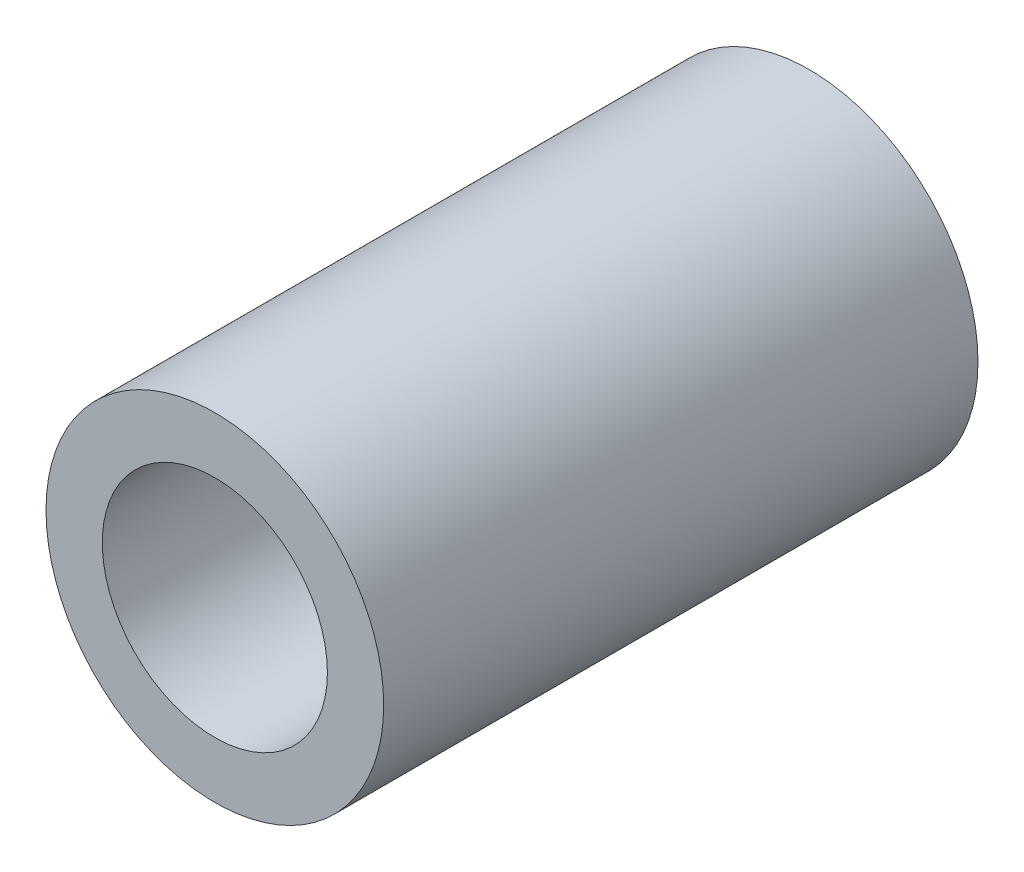
ISO-10303-21;
HEADER;
FILE_DESCRIPTION(('STEP AP214'),'2;1');
FILE_NAME('part.step','',(''),(''),'','','');
FILE_SCHEMA(('AUTOMOTIVE_DESIGN { 1 0 10303 214 1 1 1 1 }'));
ENDSEC;
DATA;
#1=APPLICATION_CONTEXT('core data for automotive mechanical design processes');
#2=APPLICATION_PROTOCOL_DEFINITION('international standard','automotive_design',2000,#1);
#3=PRODUCT_CONTEXT('',#1,'mechanical');
#4=PRODUCT('Part','Part','',(#3));
#5=PRODUCT_RELATED_PRODUCT_CATEGORY('part','',(#4));
#6=PRODUCT_DEFINITION_FORMATION('','',#4);
#7=PRODUCT_DEFINITION_CONTEXT('part definition',#1,'design');
#8=PRODUCT_DEFINITION('design','',#6,#7);
#9=PRODUCT_DEFINITION_SHAPE('','',#8);
#10=(LENGTH_UNIT() NAMED_UNIT(*) SI_UNIT(.MILLI.,.METRE.));
#11=(NAMED_UNIT(*) PLANE_ANGLE_UNIT() SI_UNIT($,.RADIAN.));
#12=(NAMED_UNIT(*) SI_UNIT($,.STERADIAN.) SOLID_ANGLE_UNIT());
#13=UNCERTAINTY_MEASURE_WITH_UNIT(LENGTH_MEASURE(1.E-05),#10,'distance_accuracy_value','');
#14=(GEOMETRIC_REPRESENTATION_CONTEXT(3) GLOBAL_UNCERTAINTY_ASSIGNED_CONTEXT((#13)) GLOBAL_UNIT_ASSIGNED_CONTEXT((#10,
#11,#12)) REPRESENTATION_CONTEXT('',''));
#15=CARTESIAN_POINT('',(0.,0.,0.));
#16=DIRECTION('',(0.,0.,1.));
#17=DIRECTION('',(1.,0.,0.));
#18=AXIS2_PLACEMENT_3D('',#15,#16,#17);
#19=CARTESIAN_POINT('',(0.,0.,33.528));
#20=DIRECTION('',(0.,0.,1.));
#21=DIRECTION('',(1.,0.,0.));
#22=AXIS2_PLACEMENT_3D('',#19,#20,#21);
#23=PLANE('',#22);
#24=CARTESIAN_POINT('',(0.,0.,33.528));
#25=DIRECTION('',(0.,0.,1.));
#26=DIRECTION('',(1.,0.,0.));
#27=AXIS2_PLACEMENT_3D('',#24,#25,#26);
#28=CIRCLE('',#27,9.525);
#29=CARTESIAN_POINT('',(9.525,0.,33.528));
#30=VERTEX_POINT('',#29);
#31=EDGE_CURVE('E10',#30,#30,#28,.T.);
#32=ORIENTED_EDGE('',*,*,#31,.T.);
#33=EDGE_LOOP('',(#32));
#34=FACE_BOUND('',#33,.T.);
#35=CARTESIAN_POINT('',(0.,0.,33.528));
#36=DIRECTION('',(0.,0.,1.));
#37=DIRECTION('',(1.,0.,0.));
#38=AXIS2_PLACEMENT_3D('',#35,#36,#37);
#39=CIRCLE('',#38,6.35);
#40=CARTESIAN_POINT('',(6.35,0.,33.528));
#41=VERTEX_POINT('',#40);
#42=EDGE_CURVE('E43',#41,#41,#39,.T.);
#43=ORIENTED_EDGE('',*,*,#42,.F.);
#44=EDGE_LOOP('',(#43));
#45=FACE_BOUND('',#44,.T.);
#46=ADVANCED_FACE('F32',(#34,#45),#23,.T.);
#47=CARTESIAN_POINT('',(0.,0.,0.));
#48=DIRECTION('',(0.,0.,1.));
#49=DIRECTION('',(1.,0.,0.));
#50=AXIS2_PLACEMENT_3D('',#47,#48,#49);
#51=PLANE('',#50);
#52=CARTESIAN_POINT('',(0.,0.,0.));
#53=DIRECTION('',(0.,0.,1.));
#54=DIRECTION('',(1.,0.,0.));
#55=AXIS2_PLACEMENT_3D('',#52,#53,#54);
#56=CIRCLE('',#55,9.525);
#57=CARTESIAN_POINT('',(9.525,0.,0.));
#58=VERTEX_POINT('',#57);
#59=EDGE_CURVE('E36',#58,#58,#56,.T.);
#60=ORIENTED_EDGE('',*,*,#59,.F.);
#61=EDGE_LOOP('',(#60));
#62=FACE_BOUND('',#61,.T.);
#63=CARTESIAN_POINT('',(0.,0.,0.));
#64=DIRECTION('',(0.,0.,1.));
#65=DIRECTION('',(1.,0.,0.));
#66=AXIS2_PLACEMENT_3D('',#63,#64,#65);
#67=CIRCLE('',#66,6.35);
#68=CARTESIAN_POINT('',(6.35,0.,0.));
#69=VERTEX_POINT('',#68);
#70=EDGE_CURVE('E45',#69,#69,#67,.T.);
#71=ORIENTED_EDGE('',*,*,#70,.T.);
#72=EDGE_LOOP('',(#71));
#73=FACE_BOUND('',#72,.T.);
#74=ADVANCED_FACE('F55',(#62,#73),#51,.F.);
#75=CARTESIAN_POINT('',(0.,0.,33.528));
#76=DIRECTION('',(0.,0.,-1.));
#77=DIRECTION('',(-1.,0.,0.));
#78=AXIS2_PLACEMENT_3D('',#75,#76,#77);
#79=CYLINDRICAL_SURFACE('',#78,9.525);
#80=ORIENTED_EDGE('',*,*,#31,.F.);
#81=EDGE_LOOP('',(#80));
#82=FACE_BOUND('',#81,.T.);
#83=ORIENTED_EDGE('',*,*,#59,.T.);
#84=EDGE_LOOP('',(#83));
#85=FACE_BOUND('',#84,.T.);
#86=ADVANCED_FACE('F34',(#82,#85),#79,.T.);
#87=CARTESIAN_POINT('',(0.,0.,33.528));
#88=DIRECTION('',(0.,0.,-1.));
#89=DIRECTION('',(-1.,0.,0.));
#90=AXIS2_PLACEMENT_3D('',#87,#88,#89);
#91=CYLINDRICAL_SURFACE('',#90,6.35);
#92=ORIENTED_EDGE('',*,*,#42,.T.);
#93=EDGE_LOOP('',(#92));
#94=FACE_BOUND('',#93,.T.);
#95=ORIENTED_EDGE('',*,*,#70,.F.);
#96=EDGE_LOOP('',(#95));
#97=FACE_BOUND('',#96,.T.);
#98=ADVANCED_FACE('F51',(#94,#97),#91,.F.);
#99=CLOSED_SHELL('',(#46,#74,#86,#98));
#100=MANIFOLD_SOLID_BREP('B2',#99);
#101=ADVANCED_BREP_SHAPE_REPRESENTATION('',(#18,#100),#14);
#102=SHAPE_DEFINITION_REPRESENTATION(#9,#101);
ENDSEC;
END-ISO-10303-21;
